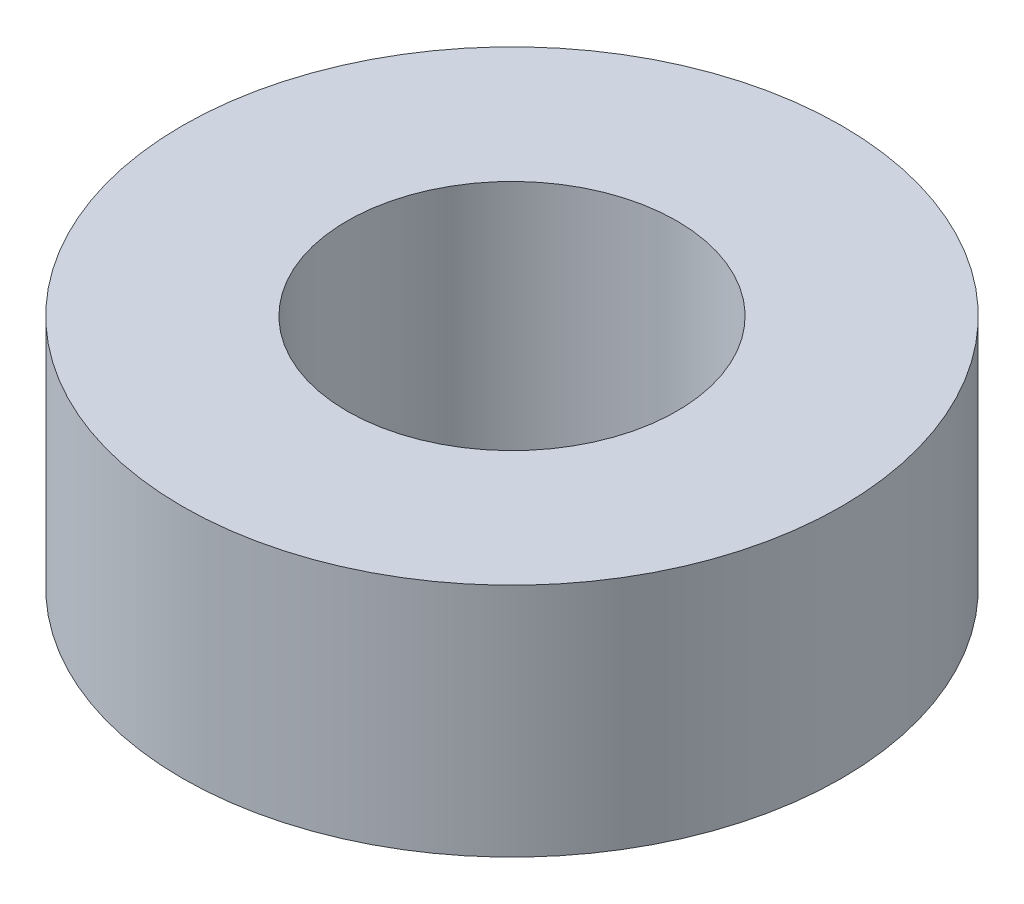
ISO-10303-21;
HEADER;
FILE_DESCRIPTION(('STEP AP214'),'2;1');
FILE_NAME('part.step','',(''),(''),'','','');
FILE_SCHEMA(('AUTOMOTIVE_DESIGN { 1 0 10303 214 1 1 1 1 }'));
ENDSEC;
DATA;
#1=APPLICATION_CONTEXT('core data for automotive mechanical design processes');
#2=APPLICATION_PROTOCOL_DEFINITION('international standard','automotive_design',2000,#1);
#3=PRODUCT_CONTEXT('',#1,'mechanical');
#4=PRODUCT('Part','Part','',(#3));
#5=PRODUCT_RELATED_PRODUCT_CATEGORY('part','',(#4));
#6=PRODUCT_DEFINITION_FORMATION('','',#4);
#7=PRODUCT_DEFINITION_CONTEXT('part definition',#1,'design');
#8=PRODUCT_DEFINITION('design','',#6,#7);
#9=PRODUCT_DEFINITION_SHAPE('','',#8);
#10=(LENGTH_UNIT() NAMED_UNIT(*) SI_UNIT(.MILLI.,.METRE.));
#11=(NAMED_UNIT(*) PLANE_ANGLE_UNIT() SI_UNIT($,.RADIAN.));
#12=(NAMED_UNIT(*) SI_UNIT($,.STERADIAN.) SOLID_ANGLE_UNIT());
#13=UNCERTAINTY_MEASURE_WITH_UNIT(LENGTH_MEASURE(1.E-05),#10,'distance_accuracy_value','');
#14=(GEOMETRIC_REPRESENTATION_CONTEXT(3) GLOBAL_UNCERTAINTY_ASSIGNED_CONTEXT((#13)) GLOBAL_UNIT_ASSIGNED_CONTEXT((#10,
#11,#12)) REPRESENTATION_CONTEXT('',''));
#15=CARTESIAN_POINT('',(0.,0.,0.));
#16=DIRECTION('',(0.,0.,1.));
#17=DIRECTION('',(1.,0.,0.));
#18=AXIS2_PLACEMENT_3D('',#15,#16,#17);
#19=CARTESIAN_POINT('',(0.,5.,0.));
#20=DIRECTION('',(0.,1.,0.));
#21=DIRECTION('',(0.,0.,1.));
#22=AXIS2_PLACEMENT_3D('',#19,#20,#21);
#23=PLANE('',#22);
#24=CARTESIAN_POINT('',(0.,5.,0.));
#25=DIRECTION('',(0.,1.,0.));
#26=DIRECTION('',(0.,0.,1.));
#27=AXIS2_PLACEMENT_3D('',#24,#25,#26);
#28=CIRCLE('',#27,7.);
#29=CARTESIAN_POINT('',(0.,5.,7.));
#30=VERTEX_POINT('',#29);
#31=EDGE_CURVE('E10',#30,#30,#28,.T.);
#32=ORIENTED_EDGE('',*,*,#31,.T.);
#33=EDGE_LOOP('',(#32));
#34=FACE_BOUND('',#33,.T.);
#35=CARTESIAN_POINT('',(0.,5.,0.));
#36=DIRECTION('',(0.,1.,0.));
#37=DIRECTION('',(0.,0.,1.));
#38=AXIS2_PLACEMENT_3D('',#35,#36,#37);
#39=CIRCLE('',#38,3.5);
#40=CARTESIAN_POINT('',(0.,5.,3.5));
#41=VERTEX_POINT('',#40);
#42=EDGE_CURVE('E46',#41,#41,#39,.T.);
#43=ORIENTED_EDGE('',*,*,#42,.F.);
#44=EDGE_LOOP('',(#43));
#45=FACE_BOUND('',#44,.T.);
#46=ADVANCED_FACE('F35',(#34,#45),#23,.T.);
#47=CARTESIAN_POINT('',(0.,0.,0.));
#48=DIRECTION('',(0.,1.,0.));
#49=DIRECTION('',(0.,0.,1.));
#50=AXIS2_PLACEMENT_3D('',#47,#48,#49);
#51=PLANE('',#50);
#52=CARTESIAN_POINT('',(0.,0.,0.));
#53=DIRECTION('',(0.,1.,0.));
#54=DIRECTION('',(0.,0.,1.));
#55=AXIS2_PLACEMENT_3D('',#52,#53,#54);
#56=CIRCLE('',#55,7.);
#57=CARTESIAN_POINT('',(0.,0.,7.));
#58=VERTEX_POINT('',#57);
#59=EDGE_CURVE('E39',#58,#58,#56,.T.);
#60=ORIENTED_EDGE('',*,*,#59,.F.);
#61=EDGE_LOOP('',(#60));
#62=FACE_BOUND('',#61,.T.);
#63=CARTESIAN_POINT('',(0.,0.,0.));
#64=DIRECTION('',(0.,1.,0.));
#65=DIRECTION('',(0.,0.,1.));
#66=AXIS2_PLACEMENT_3D('',#63,#64,#65);
#67=CIRCLE('',#66,3.5);
#68=CARTESIAN_POINT('',(0.,0.,3.5));
#69=VERTEX_POINT('',#68);
#70=EDGE_CURVE('E48',#69,#69,#67,.T.);
#71=ORIENTED_EDGE('',*,*,#70,.T.);
#72=EDGE_LOOP('',(#71));
#73=FACE_BOUND('',#72,.T.);
#74=ADVANCED_FACE('F58',(#62,#73),#51,.F.);
#75=CARTESIAN_POINT('',(0.,5.,0.));
#76=DIRECTION('',(0.,-1.,0.));
#77=DIRECTION('',(0.,0.,-1.));
#78=AXIS2_PLACEMENT_3D('',#75,#76,#77);
#79=CYLINDRICAL_SURFACE('',#78,7.);
#80=ORIENTED_EDGE('',*,*,#31,.F.);
#81=EDGE_LOOP('',(#80));
#82=FACE_BOUND('',#81,.T.);
#83=ORIENTED_EDGE('',*,*,#59,.T.);
#84=EDGE_LOOP('',(#83));
#85=FACE_BOUND('',#84,.T.);
#86=ADVANCED_FACE('F37',(#82,#85),#79,.T.);
#87=CARTESIAN_POINT('',(0.,5.,0.));
#88=DIRECTION('',(0.,-1.,0.));
#89=DIRECTION('',(0.,0.,-1.));
#90=AXIS2_PLACEMENT_3D('',#87,#88,#89);
#91=CYLINDRICAL_SURFACE('',#90,3.5);
#92=ORIENTED_EDGE('',*,*,#42,.T.);
#93=EDGE_LOOP('',(#92));
#94=FACE_BOUND('',#93,.T.);
#95=ORIENTED_EDGE('',*,*,#70,.F.);
#96=EDGE_LOOP('',(#95));
#97=FACE_BOUND('',#96,.T.);
#98=ADVANCED_FACE('F54',(#94,#97),#91,.F.);
#99=CLOSED_SHELL('',(#46,#74,#86,#98));
#100=MANIFOLD_SOLID_BREP('B2',#99);
#101=ADVANCED_BREP_SHAPE_REPRESENTATION('',(#18,#100),#14);
#102=SHAPE_DEFINITION_REPRESENTATION(#9,#101);
ENDSEC;
END-ISO-10303-21;
